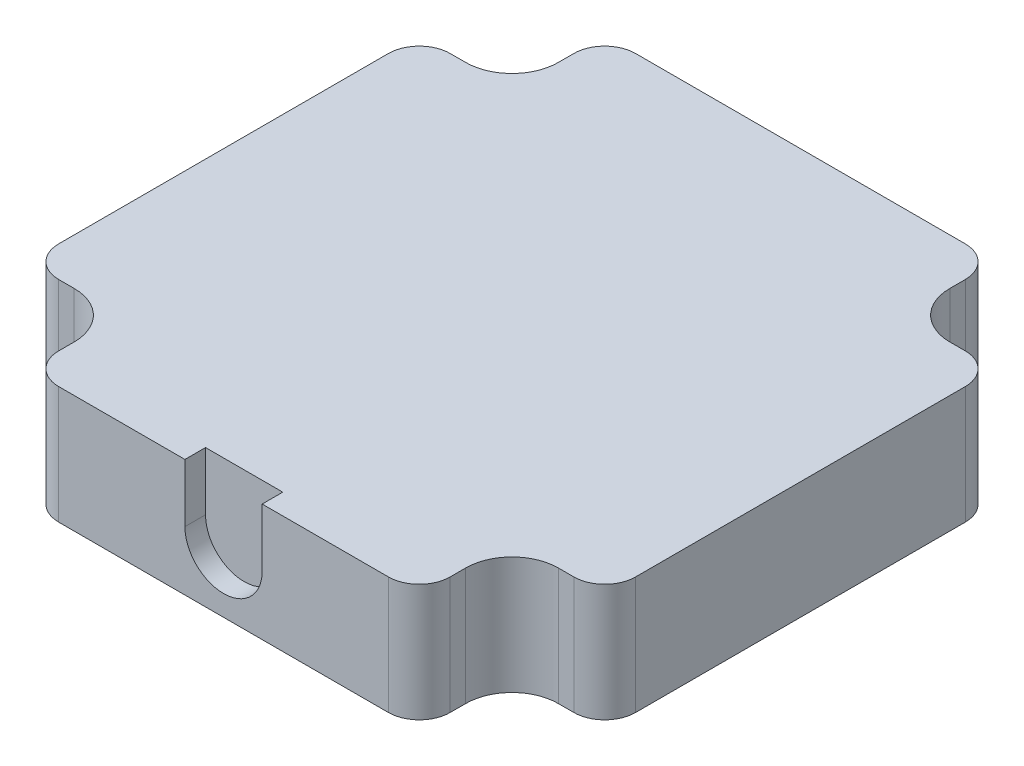
ISO-10303-21;
HEADER;
FILE_DESCRIPTION(('STEP AP214'),'2;1');
FILE_NAME('part.step','',(''),(''),'','','');
FILE_SCHEMA(('AUTOMOTIVE_DESIGN { 1 0 10303 214 1 1 1 1 }'));
ENDSEC;
DATA;
#1=APPLICATION_CONTEXT('core data for automotive mechanical design processes');
#2=APPLICATION_PROTOCOL_DEFINITION('international standard','automotive_design',2000,#1);
#3=PRODUCT_CONTEXT('',#1,'mechanical');
#4=PRODUCT('Part','Part','',(#3));
#5=PRODUCT_RELATED_PRODUCT_CATEGORY('part','',(#4));
#6=PRODUCT_DEFINITION_FORMATION('','',#4);
#7=PRODUCT_DEFINITION_CONTEXT('part definition',#1,'design');
#8=PRODUCT_DEFINITION('design','',#6,#7);
#9=PRODUCT_DEFINITION_SHAPE('','',#8);
#10=(LENGTH_UNIT() NAMED_UNIT(*) SI_UNIT(.MILLI.,.METRE.));
#11=(NAMED_UNIT(*) PLANE_ANGLE_UNIT() SI_UNIT($,.RADIAN.));
#12=(NAMED_UNIT(*) SI_UNIT($,.STERADIAN.) SOLID_ANGLE_UNIT());
#13=UNCERTAINTY_MEASURE_WITH_UNIT(LENGTH_MEASURE(1.E-05),#10,'distance_accuracy_value','');
#14=(GEOMETRIC_REPRESENTATION_CONTEXT(3) GLOBAL_UNCERTAINTY_ASSIGNED_CONTEXT((#13)) GLOBAL_UNIT_ASSIGNED_CONTEXT((#10,
#11,#12)) REPRESENTATION_CONTEXT('',''));
#15=CARTESIAN_POINT('',(0.,0.,0.));
#16=DIRECTION('',(0.,0.,1.));
#17=DIRECTION('',(1.,0.,0.));
#18=AXIS2_PLACEMENT_3D('',#15,#16,#17);
#19=CARTESIAN_POINT('',(85.5,43.3100000000018,125.18));
#20=DIRECTION('',(0.,-1.,0.));
#21=DIRECTION('',(-1.,0.,0.));
#22=AXIS2_PLACEMENT_3D('',#19,#20,#21);
#23=PLANE('',#22);
#24=CARTESIAN_POINT('',(110.6,43.3100000000017,81.08));
#25=DIRECTION('',(0.,-1.,0.));
#26=DIRECTION('',(1.,0.,0.));
#27=AXIS2_PLACEMENT_3D('',#24,#25,#26);
#28=CIRCLE('',#27,1.6);
#29=CARTESIAN_POINT('',(112.2,43.3100000000017,81.08));
#30=VERTEX_POINT('',#29);
#31=EDGE_CURVE('E343',#30,#30,#28,.T.);
#32=ORIENTED_EDGE('',*,*,#31,.T.);
#33=EDGE_LOOP('',(#32));
#34=FACE_BOUND('',#33,.T.);
#35=ADVANCED_FACE('F17',(#34),#23,.T.);
#36=CARTESIAN_POINT('',(69.4,43.3100000000019,72.08));
#37=DIRECTION('',(0.,-1.,0.));
#38=DIRECTION('',(1.,0.,0.));
#39=AXIS2_PLACEMENT_3D('',#36,#37,#38);
#40=CIRCLE('',#39,1.6);
#41=CARTESIAN_POINT('',(71.,43.3100000000018,72.08));
#42=VERTEX_POINT('',#41);
#43=EDGE_CURVE('E650',#42,#42,#40,.T.);
#44=ORIENTED_EDGE('',*,*,#43,.T.);
#45=EDGE_LOOP('',(#44));
#46=FACE_BOUND('',#45,.T.);
#47=ADVANCED_FACE('F797',(#46),#23,.T.);
#48=CARTESIAN_POINT('',(60.4,43.3100000000019,113.28));
#49=DIRECTION('',(0.,-1.,0.));
#50=DIRECTION('',(1.,0.,0.));
#51=AXIS2_PLACEMENT_3D('',#48,#49,#50);
#52=CIRCLE('',#51,1.6);
#53=CARTESIAN_POINT('',(62.,43.3100000000019,113.28));
#54=VERTEX_POINT('',#53);
#55=EDGE_CURVE('E655',#54,#54,#52,.T.);
#56=ORIENTED_EDGE('',*,*,#55,.T.);
#57=EDGE_LOOP('',(#56));
#58=FACE_BOUND('',#57,.T.);
#59=ADVANCED_FACE('F800',(#58),#23,.T.);
#60=CARTESIAN_POINT('',(101.6,43.3100000000017,122.28));
#61=DIRECTION('',(0.,-1.,0.));
#62=DIRECTION('',(1.,0.,0.));
#63=AXIS2_PLACEMENT_3D('',#60,#61,#62);
#64=CIRCLE('',#63,1.6);
#65=CARTESIAN_POINT('',(103.2,43.3100000000017,122.28));
#66=VERTEX_POINT('',#65);
#67=EDGE_CURVE('E374',#66,#66,#64,.T.);
#68=ORIENTED_EDGE('',*,*,#67,.T.);
#69=EDGE_LOOP('',(#68));
#70=FACE_BOUND('',#69,.T.);
#71=ADVANCED_FACE('F806',(#70),#23,.T.);
#72=CARTESIAN_POINT('',(59.75,40.3100000000019,116.18));
#73=DIRECTION('',(0.,0.,1.));
#74=DIRECTION('',(0.,1.,0.));
#75=AXIS2_PLACEMENT_3D('',#72,#73,#74);
#76=PLANE('',#75);
#77=DIRECTION('',(1.,0.,0.));
#78=VECTOR('',#77,1.);
#79=CARTESIAN_POINT('',(101.5,51.7100000000017,116.18));
#80=LINE('',#79,#78);
#81=CARTESIAN_POINT('',(109.,51.7100000000017,116.18));
#82=VERTEX_POINT('',#81);
#83=CARTESIAN_POINT('',(110.5,51.7100000000017,116.18));
#84=VERTEX_POINT('',#83);
#85=EDGE_CURVE('E142',#82,#84,#80,.T.);
#86=ORIENTED_EDGE('',*,*,#85,.F.);
#87=DIRECTION('',(0.,1.,0.));
#88=VECTOR('',#87,1.);
#89=CARTESIAN_POINT('',(109.,40.3100000000017,116.18));
#90=LINE('',#89,#88);
#91=CARTESIAN_POINT('',(109.,40.3100000000017,116.18));
#92=VERTEX_POINT('',#91);
#93=EDGE_CURVE('E28',#92,#82,#90,.T.);
#94=ORIENTED_EDGE('',*,*,#93,.F.);
#95=DIRECTION('',(1.,0.,0.));
#96=VECTOR('',#95,1.);
#97=CARTESIAN_POINT('',(59.75,40.3100000000019,116.18));
#98=LINE('',#97,#96);
#99=CARTESIAN_POINT('',(110.5,40.3100000000017,116.18));
#100=VERTEX_POINT('',#99);
#101=EDGE_CURVE('E140',#92,#100,#98,.T.);
#102=ORIENTED_EDGE('',*,*,#101,.T.);
#103=DIRECTION('',(0.,-1.,0.));
#104=VECTOR('',#103,1.);
#105=CARTESIAN_POINT('',(110.5,55.3100000000017,116.18));
#106=LINE('',#105,#104);
#107=EDGE_CURVE('E11',#84,#100,#106,.T.);
#108=ORIENTED_EDGE('',*,*,#107,.F.);
#109=EDGE_LOOP('',(#86,#94,#102,#108));
#110=FACE_BOUND('',#109,.T.);
#111=ADVANCED_FACE('F137',(#110),#76,.T.);
#112=CARTESIAN_POINT('',(109.,40.3100000000017,120.68));
#113=DIRECTION('',(0.,-1.,0.));
#114=DIRECTION('',(1.,0.,0.));
#115=AXIS2_PLACEMENT_3D('',#112,#113,#114);
#116=CYLINDRICAL_SURFACE('',#115,4.5);
#117=CARTESIAN_POINT('',(109.,51.7100000000017,120.68));
#118=DIRECTION('',(0.,-1.,0.));
#119=DIRECTION('',(1.,0.,0.));
#120=AXIS2_PLACEMENT_3D('',#117,#118,#119);
#121=CIRCLE('',#120,4.5);
#122=CARTESIAN_POINT('',(104.5,51.7100000000017,120.68));
#123=VERTEX_POINT('',#122);
#124=EDGE_CURVE('E178',#123,#82,#121,.T.);
#125=ORIENTED_EDGE('',*,*,#124,.F.);
#126=DIRECTION('',(0.,1.,0.));
#127=VECTOR('',#126,1.);
#128=CARTESIAN_POINT('',(104.5,40.3100000000017,120.68));
#129=LINE('',#128,#127);
#130=CARTESIAN_POINT('',(104.5,40.3100000000017,120.68));
#131=VERTEX_POINT('',#130);
#132=EDGE_CURVE('E147',#131,#123,#129,.T.);
#133=ORIENTED_EDGE('',*,*,#132,.F.);
#134=CARTESIAN_POINT('',(109.,40.3100000000017,120.68));
#135=DIRECTION('',(0.,-1.,0.));
#136=DIRECTION('',(1.,0.,0.));
#137=AXIS2_PLACEMENT_3D('',#134,#135,#136);
#138=CIRCLE('',#137,4.5);
#139=EDGE_CURVE('E150',#131,#92,#138,.T.);
#140=ORIENTED_EDGE('',*,*,#139,.T.);
#141=ORIENTED_EDGE('',*,*,#93,.T.);
#142=EDGE_LOOP('',(#125,#133,#140,#141));
#143=FACE_BOUND('',#142,.T.);
#144=ADVANCED_FACE('F151',(#143),#116,.F.);
#145=CARTESIAN_POINT('',(104.5,40.3100000000017,71.43));
#146=DIRECTION('',(1.,0.,0.));
#147=DIRECTION('',(0.,-1.,0.));
#148=AXIS2_PLACEMENT_3D('',#145,#146,#147);
#149=PLANE('',#148);
#150=DIRECTION('',(0.,0.,-1.));
#151=VECTOR('',#150,1.);
#152=CARTESIAN_POINT('',(104.5,51.7100000000017,122.18));
#153=LINE('',#152,#151);
#154=CARTESIAN_POINT('',(104.5,51.7100000000017,122.18));
#155=VERTEX_POINT('',#154);
#156=EDGE_CURVE('E174',#155,#123,#153,.T.);
#157=ORIENTED_EDGE('',*,*,#156,.F.);
#158=DIRECTION('',(0.,1.,0.));
#159=VECTOR('',#158,1.);
#160=CARTESIAN_POINT('',(104.5,17.3100000000017,122.18));
#161=LINE('',#160,#159);
#162=CARTESIAN_POINT('',(104.5,40.3100000000017,122.18));
#163=VERTEX_POINT('',#162);
#164=EDGE_CURVE('E180',#163,#155,#161,.T.);
#165=ORIENTED_EDGE('',*,*,#164,.F.);
#166=DIRECTION('',(0.,0.,-1.));
#167=VECTOR('',#166,1.);
#168=CARTESIAN_POINT('',(104.5,40.3100000000017,71.43));
#169=LINE('',#168,#167);
#170=EDGE_CURVE('E155',#163,#131,#169,.T.);
#171=ORIENTED_EDGE('',*,*,#170,.T.);
#172=ORIENTED_EDGE('',*,*,#132,.T.);
#173=EDGE_LOOP('',(#157,#165,#171,#172));
#174=FACE_BOUND('',#173,.T.);
#175=ADVANCED_FACE('F705',(#174),#149,.T.);
#176=CARTESIAN_POINT('',(81.,-5.6899999999982,125.18));
#177=DIRECTION('',(0.,0.,-1.));
#178=DIRECTION('',(0.,-1.,0.));
#179=AXIS2_PLACEMENT_3D('',#176,#177,#178);
#180=PLANE('',#179);
#181=DIRECTION('',(0.,1.,0.));
#182=VECTOR('',#181,1.);
#183=CARTESIAN_POINT('',(81.75,46.0600000000018,125.18));
#184=LINE('',#183,#182);
#185=CARTESIAN_POINT('',(81.75,46.0600000000018,125.18));
#186=VERTEX_POINT('',#185);
#187=CARTESIAN_POINT('',(81.75,51.7100000000018,125.18));
#188=VERTEX_POINT('',#187);
#189=EDGE_CURVE('E198',#186,#188,#184,.T.);
#190=ORIENTED_EDGE('',*,*,#189,.T.);
#191=DIRECTION('',(-1.,0.,0.));
#192=VECTOR('',#191,1.);
#193=CARTESIAN_POINT('',(91.25,51.7100000000018,125.18));
#194=LINE('',#193,#192);
#195=CARTESIAN_POINT('',(69.5,51.7100000000019,125.18));
#196=VERTEX_POINT('',#195);
#197=EDGE_CURVE('E338',#188,#196,#194,.T.);
#198=ORIENTED_EDGE('',*,*,#197,.T.);
#199=DIRECTION('',(0.,1.,0.));
#200=VECTOR('',#199,1.);
#201=CARTESIAN_POINT('',(69.5,17.3100000000018,125.18));
#202=LINE('',#201,#200);
#203=CARTESIAN_POINT('',(69.5,40.3100000000018,125.18));
#204=VERTEX_POINT('',#203);
#205=EDGE_CURVE('E324',#204,#196,#202,.T.);
#206=ORIENTED_EDGE('',*,*,#205,.F.);
#207=DIRECTION('',(-1.,0.,0.));
#208=VECTOR('',#207,1.);
#209=CARTESIAN_POINT('',(113.5,40.3100000000017,125.18));
#210=LINE('',#209,#208);
#211=CARTESIAN_POINT('',(101.5,40.3100000000017,125.18));
#212=VERTEX_POINT('',#211);
#213=EDGE_CURVE('E188',#212,#204,#210,.T.);
#214=ORIENTED_EDGE('',*,*,#213,.F.);
#215=DIRECTION('',(0.,-1.,0.));
#216=VECTOR('',#215,1.);
#217=CARTESIAN_POINT('',(101.5,17.3100000000017,125.18));
#218=LINE('',#217,#216);
#219=CARTESIAN_POINT('',(101.5,51.7100000000017,125.18));
#220=VERTEX_POINT('',#219);
#221=EDGE_CURVE('E173',#220,#212,#218,.T.);
#222=ORIENTED_EDGE('',*,*,#221,.F.);
#223=CARTESIAN_POINT('',(89.25,51.7100000000018,125.18));
#224=VERTEX_POINT('',#223);
#225=EDGE_CURVE('E179',#220,#224,#194,.T.);
#226=ORIENTED_EDGE('',*,*,#225,.T.);
#227=DIRECTION('',(0.,1.,0.));
#228=VECTOR('',#227,1.);
#229=CARTESIAN_POINT('',(89.25,46.0600000000018,125.18));
#230=LINE('',#229,#228);
#231=CARTESIAN_POINT('',(89.25,46.0600000000018,125.18));
#232=VERTEX_POINT('',#231);
#233=EDGE_CURVE('E349',#232,#224,#230,.T.);
#234=ORIENTED_EDGE('',*,*,#233,.F.);
#235=CARTESIAN_POINT('',(85.5,46.0600000000018,125.18));
#236=DIRECTION('',(0.,0.,1.));
#237=DIRECTION('',(-1.,0.,0.));
#238=AXIS2_PLACEMENT_3D('',#235,#236,#237);
#239=CIRCLE('',#238,3.75);
#240=EDGE_CURVE('E358',#186,#232,#239,.T.);
#241=ORIENTED_EDGE('',*,*,#240,.F.);
#242=EDGE_LOOP('',(#190,#198,#206,#214,#222,#226,#234,#241));
#243=FACE_BOUND('',#242,.T.);
#244=ADVANCED_FACE('F794',(#243),#180,.F.);
#245=CARTESIAN_POINT('',(66.5,40.3100000000018,71.43));
#246=DIRECTION('',(-1.,0.,0.));
#247=DIRECTION('',(0.,1.,0.));
#248=AXIS2_PLACEMENT_3D('',#245,#246,#247);
#249=PLANE('',#248);
#250=DIRECTION('',(0.,0.,1.));
#251=VECTOR('',#250,1.);
#252=CARTESIAN_POINT('',(66.5,51.7100000000018,122.18));
#253=LINE('',#252,#251);
#254=CARTESIAN_POINT('',(66.5,51.7100000000019,120.68));
#255=VERTEX_POINT('',#254);
#256=CARTESIAN_POINT('',(66.5,51.7100000000018,122.18));
#257=VERTEX_POINT('',#256);
#258=EDGE_CURVE('E194',#255,#257,#253,.T.);
#259=ORIENTED_EDGE('',*,*,#258,.F.);
#260=DIRECTION('',(0.,1.,0.));
#261=VECTOR('',#260,1.);
#262=CARTESIAN_POINT('',(66.5,40.3100000000019,120.68));
#263=LINE('',#262,#261);
#264=CARTESIAN_POINT('',(66.5,40.3100000000019,120.68));
#265=VERTEX_POINT('',#264);
#266=EDGE_CURVE('E193',#265,#255,#263,.T.);
#267=ORIENTED_EDGE('',*,*,#266,.F.);
#268=DIRECTION('',(0.,0.,1.));
#269=VECTOR('',#268,1.);
#270=CARTESIAN_POINT('',(66.5,40.3100000000018,71.43));
#271=LINE('',#270,#269);
#272=CARTESIAN_POINT('',(66.5,40.3100000000018,122.18));
#273=VERTEX_POINT('',#272);
#274=EDGE_CURVE('E203',#265,#273,#271,.T.);
#275=ORIENTED_EDGE('',*,*,#274,.T.);
#276=DIRECTION('',(0.,-1.,0.));
#277=VECTOR('',#276,1.);
#278=CARTESIAN_POINT('',(66.5,17.3100000000018,122.18));
#279=LINE('',#278,#277);
#280=EDGE_CURVE('E189',#257,#273,#279,.T.);
#281=ORIENTED_EDGE('',*,*,#280,.F.);
#282=EDGE_LOOP('',(#259,#267,#275,#281));
#283=FACE_BOUND('',#282,.T.);
#284=ADVANCED_FACE('F784',(#283),#249,.T.);
#285=CARTESIAN_POINT('',(62.,40.3100000000019,120.68));
#286=DIRECTION('',(0.,-1.,0.));
#287=DIRECTION('',(0.,0.,1.));
#288=AXIS2_PLACEMENT_3D('',#285,#286,#287);
#289=CYLINDRICAL_SURFACE('',#288,4.5);
#290=CARTESIAN_POINT('',(62.,51.7100000000019,120.68));
#291=DIRECTION('',(0.,-1.,0.));
#292=DIRECTION('',(0.,0.,1.));
#293=AXIS2_PLACEMENT_3D('',#290,#291,#292);
#294=CIRCLE('',#293,4.5);
#295=CARTESIAN_POINT('',(62.,51.7100000000019,116.18));
#296=VERTEX_POINT('',#295);
#297=EDGE_CURVE('E199',#296,#255,#294,.T.);
#298=ORIENTED_EDGE('',*,*,#297,.F.);
#299=DIRECTION('',(0.,1.,0.));
#300=VECTOR('',#299,1.);
#301=CARTESIAN_POINT('',(62.,40.3100000000019,116.18));
#302=LINE('',#301,#300);
#303=CARTESIAN_POINT('',(62.,40.3100000000019,116.18));
#304=VERTEX_POINT('',#303);
#305=EDGE_CURVE('E202',#304,#296,#302,.T.);
#306=ORIENTED_EDGE('',*,*,#305,.F.);
#307=CARTESIAN_POINT('',(62.,40.3100000000019,120.68));
#308=DIRECTION('',(0.,-1.,0.));
#309=DIRECTION('',(0.,0.,1.));
#310=AXIS2_PLACEMENT_3D('',#307,#308,#309);
#311=CIRCLE('',#310,4.5);
#312=EDGE_CURVE('E207',#304,#265,#311,.T.);
#313=ORIENTED_EDGE('',*,*,#312,.T.);
#314=ORIENTED_EDGE('',*,*,#266,.T.);
#315=EDGE_LOOP('',(#298,#306,#313,#314));
#316=FACE_BOUND('',#315,.T.);
#317=ADVANCED_FACE('F785',(#316),#289,.F.);
#318=DIRECTION('',(1.,0.,0.));
#319=VECTOR('',#318,1.);
#320=CARTESIAN_POINT('',(80.625,51.7100000000018,116.18));
#321=LINE('',#320,#319);
#322=CARTESIAN_POINT('',(60.5,51.7100000000019,116.18));
#323=VERTEX_POINT('',#322);
#324=EDGE_CURVE('E431',#323,#296,#321,.T.);
#325=ORIENTED_EDGE('',*,*,#324,.F.);
#326=DIRECTION('',(0.,1.,0.));
#327=VECTOR('',#326,1.);
#328=CARTESIAN_POINT('',(60.5,55.3100000000019,116.18));
#329=LINE('',#328,#327);
#330=CARTESIAN_POINT('',(60.5,40.3100000000019,116.18));
#331=VERTEX_POINT('',#330);
#332=EDGE_CURVE('E212',#331,#323,#329,.T.);
#333=ORIENTED_EDGE('',*,*,#332,.F.);
#334=DIRECTION('',(1.,0.,0.));
#335=VECTOR('',#334,1.);
#336=CARTESIAN_POINT('',(72.625,40.3100000000018,116.18));
#337=LINE('',#336,#335);
#338=EDGE_CURVE('E444',#331,#304,#337,.T.);
#339=ORIENTED_EDGE('',*,*,#338,.T.);
#340=ORIENTED_EDGE('',*,*,#305,.T.);
#341=EDGE_LOOP('',(#325,#333,#339,#340));
#342=FACE_BOUND('',#341,.T.);
#343=ADVANCED_FACE('F754',(#342),#76,.T.);
#344=CARTESIAN_POINT('',(57.5,70.3100000000019,125.18));
#345=DIRECTION('',(-1.,0.,0.));
#346=DIRECTION('',(0.,1.,0.));
#347=AXIS2_PLACEMENT_3D('',#344,#345,#346);
#348=PLANE('',#347);
#349=DIRECTION('',(0.,0.,1.));
#350=VECTOR('',#349,1.);
#351=CARTESIAN_POINT('',(57.5,51.7100000000019,123.68));
#352=LINE('',#351,#350);
#353=CARTESIAN_POINT('',(57.5,51.7100000000019,81.18));
#354=VERTEX_POINT('',#353);
#355=CARTESIAN_POINT('',(57.5,51.7100000000019,113.18));
#356=VERTEX_POINT('',#355);
#357=EDGE_CURVE('E427',#354,#356,#352,.T.);
#358=ORIENTED_EDGE('',*,*,#357,.F.);
#359=DIRECTION('',(0.,1.,0.));
#360=VECTOR('',#359,1.);
#361=CARTESIAN_POINT('',(57.5,55.3100000000019,81.18));
#362=LINE('',#361,#360);
#363=CARTESIAN_POINT('',(57.5,40.3100000000019,81.18));
#364=VERTEX_POINT('',#363);
#365=EDGE_CURVE('E312',#364,#354,#362,.T.);
#366=ORIENTED_EDGE('',*,*,#365,.F.);
#367=DIRECTION('',(0.,0.,-1.));
#368=VECTOR('',#367,1.);
#369=CARTESIAN_POINT('',(57.5,40.3100000000019,125.18));
#370=LINE('',#369,#368);
#371=CARTESIAN_POINT('',(57.5,40.3100000000019,113.18));
#372=VERTEX_POINT('',#371);
#373=EDGE_CURVE('E410',#372,#364,#370,.T.);
#374=ORIENTED_EDGE('',*,*,#373,.F.);
#375=DIRECTION('',(0.,-1.,0.));
#376=VECTOR('',#375,1.);
#377=CARTESIAN_POINT('',(57.5,55.3100000000019,113.18));
#378=LINE('',#377,#376);
#379=EDGE_CURVE('E316',#356,#372,#378,.T.);
#380=ORIENTED_EDGE('',*,*,#379,.F.);
#381=EDGE_LOOP('',(#358,#366,#374,#380));
#382=FACE_BOUND('',#381,.T.);
#383=ADVANCED_FACE('F742',(#382),#348,.T.);
#384=CARTESIAN_POINT('',(81.,-5.6899999999982,69.18));
#385=DIRECTION('',(0.,0.,-1.));
#386=DIRECTION('',(0.,-1.,0.));
#387=AXIS2_PLACEMENT_3D('',#384,#385,#386);
#388=PLANE('',#387);
#389=DIRECTION('',(-1.,0.,0.));
#390=VECTOR('',#389,1.);
#391=CARTESIAN_POINT('',(91.25,51.7100000000018,69.18));
#392=LINE('',#391,#390);
#393=CARTESIAN_POINT('',(101.5,51.7100000000018,69.18));
#394=VERTEX_POINT('',#393);
#395=CARTESIAN_POINT('',(69.5,51.7100000000019,69.18));
#396=VERTEX_POINT('',#395);
#397=EDGE_CURVE('E259',#394,#396,#392,.T.);
#398=ORIENTED_EDGE('',*,*,#397,.F.);
#399=DIRECTION('',(0.,1.,0.));
#400=VECTOR('',#399,1.);
#401=CARTESIAN_POINT('',(101.5,17.3100000000017,69.18));
#402=LINE('',#401,#400);
#403=CARTESIAN_POINT('',(101.5,40.3100000000017,69.18));
#404=VERTEX_POINT('',#403);
#405=EDGE_CURVE('E400',#404,#394,#402,.T.);
#406=ORIENTED_EDGE('',*,*,#405,.F.);
#407=DIRECTION('',(1.,0.,0.));
#408=VECTOR('',#407,1.);
#409=CARTESIAN_POINT('',(113.5,40.3100000000017,69.18));
#410=LINE('',#409,#408);
#411=CARTESIAN_POINT('',(69.5,40.3100000000018,69.18));
#412=VERTEX_POINT('',#411);
#413=EDGE_CURVE('E213',#412,#404,#410,.T.);
#414=ORIENTED_EDGE('',*,*,#413,.F.);
#415=DIRECTION('',(0.,-1.,0.));
#416=VECTOR('',#415,1.);
#417=CARTESIAN_POINT('',(69.5,17.3100000000018,69.18));
#418=LINE('',#417,#416);
#419=EDGE_CURVE('E304',#396,#412,#418,.T.);
#420=ORIENTED_EDGE('',*,*,#419,.F.);
#421=EDGE_LOOP('',(#398,#406,#414,#420));
#422=FACE_BOUND('',#421,.T.);
#423=ADVANCED_FACE('F951',(#422),#388,.T.);
#424=CARTESIAN_POINT('',(59.75,40.3100000000019,78.18));
#425=DIRECTION('',(0.,0.,-1.));
#426=DIRECTION('',(0.,-1.,0.));
#427=AXIS2_PLACEMENT_3D('',#424,#425,#426);
#428=PLANE('',#427);
#429=DIRECTION('',(-1.,0.,0.));
#430=VECTOR('',#429,1.);
#431=CARTESIAN_POINT('',(101.5,51.7100000000017,78.18));
#432=LINE('',#431,#430);
#433=CARTESIAN_POINT('',(110.5,51.7100000000017,78.18));
#434=VERTEX_POINT('',#433);
#435=CARTESIAN_POINT('',(109.,51.7100000000017,78.18));
#436=VERTEX_POINT('',#435);
#437=EDGE_CURVE('E214',#434,#436,#432,.T.);
#438=ORIENTED_EDGE('',*,*,#437,.F.);
#439=DIRECTION('',(0.,1.,0.));
#440=VECTOR('',#439,1.);
#441=CARTESIAN_POINT('',(110.5,55.3100000000017,78.18));
#442=LINE('',#441,#440);
#443=CARTESIAN_POINT('',(110.5,40.3100000000017,78.18));
#444=VERTEX_POINT('',#443);
#445=EDGE_CURVE('E208',#444,#434,#442,.T.);
#446=ORIENTED_EDGE('',*,*,#445,.F.);
#447=DIRECTION('',(-1.,0.,0.));
#448=VECTOR('',#447,1.);
#449=CARTESIAN_POINT('',(59.75,40.3100000000019,78.18));
#450=LINE('',#449,#448);
#451=CARTESIAN_POINT('',(109.,40.3100000000017,78.18));
#452=VERTEX_POINT('',#451);
#453=EDGE_CURVE('E164',#444,#452,#450,.T.);
#454=ORIENTED_EDGE('',*,*,#453,.T.);
#455=DIRECTION('',(0.,1.,0.));
#456=VECTOR('',#455,1.);
#457=CARTESIAN_POINT('',(109.,40.3100000000017,78.18));
#458=LINE('',#457,#456);
#459=EDGE_CURVE('E21',#452,#436,#458,.T.);
#460=ORIENTED_EDGE('',*,*,#459,.T.);
#461=EDGE_LOOP('',(#438,#446,#454,#460));
#462=FACE_BOUND('',#461,.T.);
#463=ADVANCED_FACE('F19',(#462),#428,.T.);
#464=CARTESIAN_POINT('',(85.5,40.3100000000018,125.18));
#465=DIRECTION('',(0.,-1.,0.));
#466=DIRECTION('',(-1.,0.,0.));
#467=AXIS2_PLACEMENT_3D('',#464,#465,#466);
#468=PLANE('',#467);
#469=CARTESIAN_POINT('',(101.5,40.3100000000017,72.18));
#470=DIRECTION('',(0.,1.,0.));
#471=DIRECTION('',(0.707106781186551,0.,-0.707106781186544));
#472=AXIS2_PLACEMENT_3D('',#469,#470,#471);
#473=CIRCLE('',#472,3.);
#474=CARTESIAN_POINT('',(104.5,40.3100000000017,72.18));
#475=VERTEX_POINT('',#474);
#476=EDGE_CURVE('E404',#475,#404,#473,.T.);
#477=ORIENTED_EDGE('',*,*,#476,.F.);
#478=DIRECTION('',(0.,0.,-1.));
#479=VECTOR('',#478,1.);
#480=CARTESIAN_POINT('',(104.5,40.3100000000017,98.305));
#481=LINE('',#480,#479);
#482=CARTESIAN_POINT('',(104.5,40.3100000000017,73.68));
#483=VERTEX_POINT('',#482);
#484=EDGE_CURVE('E268',#483,#475,#481,.T.);
#485=ORIENTED_EDGE('',*,*,#484,.F.);
#486=CARTESIAN_POINT('',(109.,40.3100000000017,73.68));
#487=DIRECTION('',(0.,-1.,0.));
#488=DIRECTION('',(0.,0.,-1.));
#489=AXIS2_PLACEMENT_3D('',#486,#487,#488);
#490=CIRCLE('',#489,4.5);
#491=EDGE_CURVE('E291',#452,#483,#490,.T.);
#492=ORIENTED_EDGE('',*,*,#491,.F.);
#493=ORIENTED_EDGE('',*,*,#453,.F.);
#494=CARTESIAN_POINT('',(110.5,40.3100000000017,81.18));
#495=DIRECTION('',(0.,1.,0.));
#496=DIRECTION('',(0.707106781186557,0.,-0.707106781186538));
#497=AXIS2_PLACEMENT_3D('',#494,#495,#496);
#498=CIRCLE('',#497,3.);
#499=CARTESIAN_POINT('',(113.5,40.3100000000017,81.18));
#500=VERTEX_POINT('',#499);
#501=EDGE_CURVE('E252',#500,#444,#498,.T.);
#502=ORIENTED_EDGE('',*,*,#501,.F.);
#503=DIRECTION('',(0.,0.,-1.));
#504=VECTOR('',#503,1.);
#505=CARTESIAN_POINT('',(113.5,40.3100000000017,125.18));
#506=LINE('',#505,#504);
#507=CARTESIAN_POINT('',(113.5,40.3100000000017,113.18));
#508=VERTEX_POINT('',#507);
#509=EDGE_CURVE('E269',#508,#500,#506,.T.);
#510=ORIENTED_EDGE('',*,*,#509,.F.);
#511=CARTESIAN_POINT('',(110.5,40.3100000000017,113.18));
#512=DIRECTION('',(0.,1.,0.));
#513=DIRECTION('',(0.707106781186544,0.,0.707106781186551));
#514=AXIS2_PLACEMENT_3D('',#511,#512,#513);
#515=CIRCLE('',#514,3.);
#516=EDGE_CURVE('E162',#100,#508,#515,.T.);
#517=ORIENTED_EDGE('',*,*,#516,.F.);
#518=ORIENTED_EDGE('',*,*,#101,.F.);
#519=ORIENTED_EDGE('',*,*,#139,.F.);
#520=ORIENTED_EDGE('',*,*,#170,.F.);
#521=CARTESIAN_POINT('',(101.5,40.3100000000017,122.18));
#522=DIRECTION('',(0.,1.,0.));
#523=DIRECTION('',(0.707106781186541,0.,0.707106781186554));
#524=AXIS2_PLACEMENT_3D('',#521,#522,#523);
#525=CIRCLE('',#524,3.);
#526=EDGE_CURVE('E185',#212,#163,#525,.T.);
#527=ORIENTED_EDGE('',*,*,#526,.F.);
#528=ORIENTED_EDGE('',*,*,#213,.T.);
#529=CARTESIAN_POINT('',(69.5,40.3100000000018,122.18));
#530=DIRECTION('',(0.,1.,0.));
#531=DIRECTION('',(-0.707106781186551,0.,0.707106781186544));
#532=AXIS2_PLACEMENT_3D('',#529,#530,#531);
#533=CIRCLE('',#532,3.);
#534=EDGE_CURVE('E687',#273,#204,#533,.T.);
#535=ORIENTED_EDGE('',*,*,#534,.F.);
#536=ORIENTED_EDGE('',*,*,#274,.F.);
#537=ORIENTED_EDGE('',*,*,#312,.F.);
#538=ORIENTED_EDGE('',*,*,#338,.F.);
#539=CARTESIAN_POINT('',(60.5,40.3100000000019,113.18));
#540=DIRECTION('',(0.,1.,0.));
#541=DIRECTION('',(-0.707106781186554,0.,0.707106781186541));
#542=AXIS2_PLACEMENT_3D('',#539,#540,#541);
#543=CIRCLE('',#542,3.);
#544=EDGE_CURVE('E41',#372,#331,#543,.T.);
#545=ORIENTED_EDGE('',*,*,#544,.F.);
#546=ORIENTED_EDGE('',*,*,#373,.T.);
#547=CARTESIAN_POINT('',(60.5,40.3100000000019,81.18));
#548=DIRECTION('',(0.,1.,0.));
#549=DIRECTION('',(-0.707106781186539,0.,-0.707106781186556));
#550=AXIS2_PLACEMENT_3D('',#547,#548,#549);
#551=CIRCLE('',#550,3.);
#552=CARTESIAN_POINT('',(60.5,40.3100000000019,78.18));
#553=VERTEX_POINT('',#552);
#554=EDGE_CURVE('E438',#553,#364,#551,.T.);
#555=ORIENTED_EDGE('',*,*,#554,.F.);
#556=DIRECTION('',(-1.,0.,0.));
#557=VECTOR('',#556,1.);
#558=CARTESIAN_POINT('',(72.625,40.3100000000018,78.18));
#559=LINE('',#558,#557);
#560=CARTESIAN_POINT('',(62.,40.3100000000019,78.18));
#561=VERTEX_POINT('',#560);
#562=EDGE_CURVE('E465',#561,#553,#559,.T.);
#563=ORIENTED_EDGE('',*,*,#562,.F.);
#564=CARTESIAN_POINT('',(62.,40.3100000000019,73.68));
#565=DIRECTION('',(0.,-1.,0.));
#566=DIRECTION('',(-1.,0.,0.));
#567=AXIS2_PLACEMENT_3D('',#564,#565,#566);
#568=CIRCLE('',#567,4.5);
#569=CARTESIAN_POINT('',(66.5,40.3100000000019,73.68));
#570=VERTEX_POINT('',#569);
#571=EDGE_CURVE('E283',#570,#561,#568,.T.);
#572=ORIENTED_EDGE('',*,*,#571,.F.);
#573=DIRECTION('',(0.,0.,1.));
#574=VECTOR('',#573,1.);
#575=CARTESIAN_POINT('',(66.5,40.3100000000019,98.305));
#576=LINE('',#575,#574);
#577=CARTESIAN_POINT('',(66.5,40.3100000000019,72.18));
#578=VERTEX_POINT('',#577);
#579=EDGE_CURVE('E168',#578,#570,#576,.T.);
#580=ORIENTED_EDGE('',*,*,#579,.F.);
#581=CARTESIAN_POINT('',(69.5,40.3100000000018,72.18));
#582=DIRECTION('',(0.,1.,0.));
#583=DIRECTION('',(-0.707106781186544,0.,-0.707106781186551));
#584=AXIS2_PLACEMENT_3D('',#581,#582,#583);
#585=CIRCLE('',#584,3.);
#586=EDGE_CURVE('E416',#412,#578,#585,.T.);
#587=ORIENTED_EDGE('',*,*,#586,.F.);
#588=ORIENTED_EDGE('',*,*,#413,.T.);
#589=EDGE_LOOP('',(#477,#485,#492,#493,#502,#510,#517,#518,#519,#520,#527,#528,#535,#536,#537,
#538,#545,#546,#555,#563,#572,#580,#587,#588));
#590=FACE_BOUND('',#589,.T.);
#591=CARTESIAN_POINT('',(85.5,40.3100000000018,97.18));
#592=DIRECTION('',(0.,-1.,0.));
#593=DIRECTION('',(1.,0.,0.));
#594=AXIS2_PLACEMENT_3D('',#591,#592,#593);
#595=CIRCLE('',#594,4.75);
#596=CARTESIAN_POINT('',(90.25,40.3100000000018,97.18));
#597=VERTEX_POINT('',#596);
#598=EDGE_CURVE('E423',#597,#597,#595,.T.);
#599=ORIENTED_EDGE('',*,*,#598,.F.);
#600=EDGE_LOOP('',(#599));
#601=FACE_BOUND('',#600,.T.);
#602=CARTESIAN_POINT('',(101.6,40.3100000000017,122.28));
#603=DIRECTION('',(0.,-1.,0.));
#604=DIRECTION('',(1.,0.,0.));
#605=AXIS2_PLACEMENT_3D('',#602,#603,#604);
#606=CIRCLE('',#605,1.6);
#607=CARTESIAN_POINT('',(103.2,40.3100000000017,122.28));
#608=VERTEX_POINT('',#607);
#609=EDGE_CURVE('E484',#608,#608,#606,.T.);
#610=ORIENTED_EDGE('',*,*,#609,.F.);
#611=EDGE_LOOP('',(#610));
#612=FACE_BOUND('',#611,.T.);
#613=CARTESIAN_POINT('',(60.4,40.3100000000019,113.28));
#614=DIRECTION('',(0.,-1.,0.));
#615=DIRECTION('',(0.,0.,1.));
#616=AXIS2_PLACEMENT_3D('',#613,#614,#615);
#617=CIRCLE('',#616,1.6);
#618=CARTESIAN_POINT('',(60.4,40.3100000000019,114.88));
#619=VERTEX_POINT('',#618);
#620=EDGE_CURVE('E656',#619,#619,#617,.T.);
#621=ORIENTED_EDGE('',*,*,#620,.F.);
#622=EDGE_LOOP('',(#621));
#623=FACE_BOUND('',#622,.T.);
#624=CARTESIAN_POINT('',(69.4,40.3100000000018,72.08));
#625=DIRECTION('',(0.,-1.,0.));
#626=DIRECTION('',(-1.,0.,0.));
#627=AXIS2_PLACEMENT_3D('',#624,#625,#626);
#628=CIRCLE('',#627,1.6);
#629=CARTESIAN_POINT('',(67.8,40.3100000000018,72.08));
#630=VERTEX_POINT('',#629);
#631=EDGE_CURVE('E651',#630,#630,#628,.T.);
#632=ORIENTED_EDGE('',*,*,#631,.F.);
#633=EDGE_LOOP('',(#632));
#634=FACE_BOUND('',#633,.T.);
#635=CARTESIAN_POINT('',(110.6,40.3100000000017,81.08));
#636=DIRECTION('',(0.,-1.,0.));
#637=DIRECTION('',(0.,0.,-1.));
#638=AXIS2_PLACEMENT_3D('',#635,#636,#637);
#639=CIRCLE('',#638,1.6);
#640=CARTESIAN_POINT('',(110.6,40.3100000000017,79.48));
#641=VERTEX_POINT('',#640);
#642=EDGE_CURVE('E646',#641,#641,#639,.T.);
#643=ORIENTED_EDGE('',*,*,#642,.F.);
#644=EDGE_LOOP('',(#643));
#645=FACE_BOUND('',#644,.T.);
#646=ADVANCED_FACE('F158',(#590,#601,#612,#623,#634,#645),#468,.T.);
#647=DIRECTION('',(0.,0.,1.));
#648=VECTOR('',#647,1.);
#649=CARTESIAN_POINT('',(66.5,51.7100000000019,96.805));
#650=LINE('',#649,#648);
#651=CARTESIAN_POINT('',(66.5,51.7100000000019,72.18));
#652=VERTEX_POINT('',#651);
#653=CARTESIAN_POINT('',(66.5,51.7100000000019,73.68));
#654=VERTEX_POINT('',#653);
#655=EDGE_CURVE('E272',#652,#654,#650,.T.);
#656=ORIENTED_EDGE('',*,*,#655,.F.);
#657=DIRECTION('',(0.,1.,0.));
#658=VECTOR('',#657,1.);
#659=CARTESIAN_POINT('',(66.5,17.3100000000019,72.18));
#660=LINE('',#659,#658);
#661=EDGE_CURVE('E287',#578,#652,#660,.T.);
#662=ORIENTED_EDGE('',*,*,#661,.F.);
#663=ORIENTED_EDGE('',*,*,#579,.T.);
#664=DIRECTION('',(0.,1.,0.));
#665=VECTOR('',#664,1.);
#666=CARTESIAN_POINT('',(66.5,40.3100000000018,73.68));
#667=LINE('',#666,#665);
#668=EDGE_CURVE('E279',#570,#654,#667,.T.);
#669=ORIENTED_EDGE('',*,*,#668,.T.);
#670=EDGE_LOOP('',(#656,#662,#663,#669));
#671=FACE_BOUND('',#670,.T.);
#672=ADVANCED_FACE('F615',(#671),#249,.T.);
#673=CARTESIAN_POINT('',(109.,40.3100000000017,73.68));
#674=DIRECTION('',(0.,-1.,0.));
#675=DIRECTION('',(0.,0.,-1.));
#676=AXIS2_PLACEMENT_3D('',#673,#674,#675);
#677=CYLINDRICAL_SURFACE('',#676,4.5);
#678=CARTESIAN_POINT('',(109.,51.7100000000017,73.68));
#679=DIRECTION('',(0.,-1.,0.));
#680=DIRECTION('',(0.,0.,-1.));
#681=AXIS2_PLACEMENT_3D('',#678,#679,#680);
#682=CIRCLE('',#681,4.5);
#683=CARTESIAN_POINT('',(104.5,51.7100000000017,73.68));
#684=VERTEX_POINT('',#683);
#685=EDGE_CURVE('E217',#436,#684,#682,.T.);
#686=ORIENTED_EDGE('',*,*,#685,.F.);
#687=ORIENTED_EDGE('',*,*,#459,.F.);
#688=ORIENTED_EDGE('',*,*,#491,.T.);
#689=DIRECTION('',(0.,1.,0.));
#690=VECTOR('',#689,1.);
#691=CARTESIAN_POINT('',(104.5,40.3100000000017,73.68));
#692=LINE('',#691,#690);
#693=EDGE_CURVE('E264',#483,#684,#692,.T.);
#694=ORIENTED_EDGE('',*,*,#693,.T.);
#695=EDGE_LOOP('',(#686,#687,#688,#694));
#696=FACE_BOUND('',#695,.T.);
#697=ADVANCED_FACE('F854',(#696),#677,.F.);
#698=DIRECTION('',(0.,0.,-1.));
#699=VECTOR('',#698,1.);
#700=CARTESIAN_POINT('',(104.5,51.7100000000017,96.805));
#701=LINE('',#700,#699);
#702=CARTESIAN_POINT('',(104.5,51.7100000000018,72.18));
#703=VERTEX_POINT('',#702);
#704=EDGE_CURVE('E225',#684,#703,#701,.T.);
#705=ORIENTED_EDGE('',*,*,#704,.F.);
#706=ORIENTED_EDGE('',*,*,#693,.F.);
#707=ORIENTED_EDGE('',*,*,#484,.T.);
#708=DIRECTION('',(0.,-1.,0.));
#709=VECTOR('',#708,1.);
#710=CARTESIAN_POINT('',(104.5,17.3100000000017,72.18));
#711=LINE('',#710,#709);
#712=EDGE_CURVE('E389',#703,#475,#711,.T.);
#713=ORIENTED_EDGE('',*,*,#712,.F.);
#714=EDGE_LOOP('',(#705,#706,#707,#713));
#715=FACE_BOUND('',#714,.T.);
#716=ADVANCED_FACE('F851',(#715),#149,.T.);
#717=CARTESIAN_POINT('',(113.5,70.3100000000017,125.18));
#718=DIRECTION('',(1.,0.,0.));
#719=DIRECTION('',(0.,-1.,0.));
#720=AXIS2_PLACEMENT_3D('',#717,#718,#719);
#721=PLANE('',#720);
#722=DIRECTION('',(0.,0.,-1.));
#723=VECTOR('',#722,1.);
#724=CARTESIAN_POINT('',(113.5,51.7100000000017,123.68));
#725=LINE('',#724,#723);
#726=CARTESIAN_POINT('',(113.5,51.7100000000017,113.18));
#727=VERTEX_POINT('',#726);
#728=CARTESIAN_POINT('',(113.5,51.7100000000017,81.18));
#729=VERTEX_POINT('',#728);
#730=EDGE_CURVE('E218',#727,#729,#725,.T.);
#731=ORIENTED_EDGE('',*,*,#730,.F.);
#732=DIRECTION('',(0.,1.,0.));
#733=VECTOR('',#732,1.);
#734=CARTESIAN_POINT('',(113.5,55.3100000000017,113.18));
#735=LINE('',#734,#733);
#736=EDGE_CURVE('E241',#508,#727,#735,.T.);
#737=ORIENTED_EDGE('',*,*,#736,.F.);
#738=ORIENTED_EDGE('',*,*,#509,.T.);
#739=DIRECTION('',(0.,-1.,0.));
#740=VECTOR('',#739,1.);
#741=CARTESIAN_POINT('',(113.5,55.3100000000017,81.18));
#742=LINE('',#741,#740);
#743=EDGE_CURVE('E248',#729,#500,#742,.T.);
#744=ORIENTED_EDGE('',*,*,#743,.F.);
#745=EDGE_LOOP('',(#731,#737,#738,#744));
#746=FACE_BOUND('',#745,.T.);
#747=ADVANCED_FACE('F864',(#746),#721,.T.);
#748=CARTESIAN_POINT('',(62.,40.3100000000019,73.68));
#749=DIRECTION('',(0.,-1.,0.));
#750=DIRECTION('',(-1.,0.,0.));
#751=AXIS2_PLACEMENT_3D('',#748,#749,#750);
#752=CYLINDRICAL_SURFACE('',#751,4.5);
#753=CARTESIAN_POINT('',(62.,51.7100000000019,73.68));
#754=DIRECTION('',(0.,-1.,0.));
#755=DIRECTION('',(-1.,0.,0.));
#756=AXIS2_PLACEMENT_3D('',#753,#754,#755);
#757=CIRCLE('',#756,4.5);
#758=CARTESIAN_POINT('',(62.,51.7100000000019,78.18));
#759=VERTEX_POINT('',#758);
#760=EDGE_CURVE('E276',#654,#759,#757,.T.);
#761=ORIENTED_EDGE('',*,*,#760,.F.);
#762=ORIENTED_EDGE('',*,*,#668,.F.);
#763=ORIENTED_EDGE('',*,*,#571,.T.);
#764=DIRECTION('',(0.,1.,0.));
#765=VECTOR('',#764,1.);
#766=CARTESIAN_POINT('',(62.,40.3100000000019,78.18));
#767=LINE('',#766,#765);
#768=EDGE_CURVE('E362',#561,#759,#767,.T.);
#769=ORIENTED_EDGE('',*,*,#768,.T.);
#770=EDGE_LOOP('',(#761,#762,#763,#769));
#771=FACE_BOUND('',#770,.T.);
#772=ADVANCED_FACE('F635',(#771),#752,.F.);
#773=DIRECTION('',(-1.,0.,0.));
#774=VECTOR('',#773,1.);
#775=CARTESIAN_POINT('',(80.625,51.7100000000018,78.18));
#776=LINE('',#775,#774);
#777=CARTESIAN_POINT('',(60.5,51.7100000000019,78.18));
#778=VERTEX_POINT('',#777);
#779=EDGE_CURVE('E432',#759,#778,#776,.T.);
#780=ORIENTED_EDGE('',*,*,#779,.F.);
#781=ORIENTED_EDGE('',*,*,#768,.F.);
#782=ORIENTED_EDGE('',*,*,#562,.T.);
#783=DIRECTION('',(0.,-1.,0.));
#784=VECTOR('',#783,1.);
#785=CARTESIAN_POINT('',(60.5,55.3100000000019,78.18));
#786=LINE('',#785,#784);
#787=EDGE_CURVE('E284',#778,#553,#786,.T.);
#788=ORIENTED_EDGE('',*,*,#787,.F.);
#789=EDGE_LOOP('',(#780,#781,#782,#788));
#790=FACE_BOUND('',#789,.T.);
#791=ADVANCED_FACE('F638',(#790),#428,.T.);
#792=CARTESIAN_POINT('',(85.5,43.3100000000018,97.18));
#793=DIRECTION('',(0.,1.,0.));
#794=DIRECTION('',(1.,0.,0.));
#795=AXIS2_PLACEMENT_3D('',#792,#793,#794);
#796=CIRCLE('',#795,4.75);
#797=CARTESIAN_POINT('',(90.25,43.3100000000018,97.18));
#798=VERTEX_POINT('',#797);
#799=EDGE_CURVE('E419',#798,#798,#796,.T.);
#800=ORIENTED_EDGE('',*,*,#799,.F.);
#801=EDGE_LOOP('',(#800));
#802=FACE_BOUND('',#801,.T.);
#803=ADVANCED_FACE('F801',(#802),#23,.T.);
#804=CARTESIAN_POINT('',(85.5,46.0600000000018,125.18));
#805=DIRECTION('',(0.,0.,1.));
#806=DIRECTION('',(-1.,0.,0.));
#807=AXIS2_PLACEMENT_3D('',#804,#805,#806);
#808=CYLINDRICAL_SURFACE('',#807,3.75);
#809=CARTESIAN_POINT('',(85.5,46.0600000000018,123.18));
#810=DIRECTION('',(0.,0.,-1.));
#811=DIRECTION('',(-1.,0.,0.));
#812=AXIS2_PLACEMENT_3D('',#809,#810,#811);
#813=CIRCLE('',#812,3.75);
#814=CARTESIAN_POINT('',(89.25,46.0600000000018,123.18));
#815=VERTEX_POINT('',#814);
#816=CARTESIAN_POINT('',(81.75,46.0600000000018,123.18));
#817=VERTEX_POINT('',#816);
#818=EDGE_CURVE('E354',#815,#817,#813,.T.);
#819=ORIENTED_EDGE('',*,*,#818,.T.);
#820=DIRECTION('',(0.,0.,1.));
#821=VECTOR('',#820,1.);
#822=CARTESIAN_POINT('',(81.75,46.0600000000018,125.18));
#823=LINE('',#822,#821);
#824=EDGE_CURVE('E335',#817,#186,#823,.T.);
#825=ORIENTED_EDGE('',*,*,#824,.T.);
#826=ORIENTED_EDGE('',*,*,#240,.T.);
#827=DIRECTION('',(0.,0.,1.));
#828=VECTOR('',#827,1.);
#829=CARTESIAN_POINT('',(89.25,46.0600000000018,125.18));
#830=LINE('',#829,#828);
#831=EDGE_CURVE('E355',#815,#232,#830,.T.);
#832=ORIENTED_EDGE('',*,*,#831,.F.);
#833=EDGE_LOOP('',(#819,#825,#826,#832));
#834=FACE_BOUND('',#833,.T.);
#835=ADVANCED_FACE('F813',(#834),#808,.F.);
#836=CARTESIAN_POINT('',(81.,-5.6899999999982,123.18));
#837=DIRECTION('',(0.,0.,-1.));
#838=DIRECTION('',(0.,-1.,0.));
#839=AXIS2_PLACEMENT_3D('',#836,#837,#838);
#840=PLANE('',#839);
#841=ORIENTED_EDGE('',*,*,#818,.F.);
#842=DIRECTION('',(0.,-1.,0.));
#843=VECTOR('',#842,1.);
#844=CARTESIAN_POINT('',(89.25,21.6225000000018,123.18));
#845=LINE('',#844,#843);
#846=CARTESIAN_POINT('',(89.25,51.7100000000018,123.18));
#847=VERTEX_POINT('',#846);
#848=EDGE_CURVE('E1371',#847,#815,#845,.T.);
#849=ORIENTED_EDGE('',*,*,#848,.F.);
#850=DIRECTION('',(-1.,0.,0.));
#851=VECTOR('',#850,1.);
#852=CARTESIAN_POINT('',(91.25,51.7100000000018,123.18));
#853=LINE('',#852,#851);
#854=CARTESIAN_POINT('',(81.75,51.7100000000018,123.18));
#855=VERTEX_POINT('',#854);
#856=EDGE_CURVE('E1347',#847,#855,#853,.T.);
#857=ORIENTED_EDGE('',*,*,#856,.T.);
#858=DIRECTION('',(0.,1.,0.));
#859=VECTOR('',#858,1.);
#860=CARTESIAN_POINT('',(81.75,21.6225000000018,123.18));
#861=LINE('',#860,#859);
#862=EDGE_CURVE('E1343',#817,#855,#861,.T.);
#863=ORIENTED_EDGE('',*,*,#862,.F.);
#864=EDGE_LOOP('',(#841,#849,#857,#863));
#865=FACE_BOUND('',#864,.T.);
#866=ADVANCED_FACE('F819',(#865),#840,.F.);
#867=CARTESIAN_POINT('',(89.25,48.9350000000018,125.18));
#868=DIRECTION('',(1.,0.,0.));
#869=DIRECTION('',(0.,1.,0.));
#870=AXIS2_PLACEMENT_3D('',#867,#868,#869);
#871=PLANE('',#870);
#872=ORIENTED_EDGE('',*,*,#848,.T.);
#873=ORIENTED_EDGE('',*,*,#831,.T.);
#874=ORIENTED_EDGE('',*,*,#233,.T.);
#875=DIRECTION('',(0.,0.,-1.));
#876=VECTOR('',#875,1.);
#877=CARTESIAN_POINT('',(89.25,51.7100000000018,123.68));
#878=LINE('',#877,#876);
#879=EDGE_CURVE('E1359',#224,#847,#878,.T.);
#880=ORIENTED_EDGE('',*,*,#879,.T.);
#881=EDGE_LOOP('',(#872,#873,#874,#880));
#882=FACE_BOUND('',#881,.T.);
#883=ADVANCED_FACE('F928',(#882),#871,.F.);
#884=CARTESIAN_POINT('',(81.75,48.9350000000018,125.18));
#885=DIRECTION('',(-1.,0.,0.));
#886=DIRECTION('',(0.,-1.,0.));
#887=AXIS2_PLACEMENT_3D('',#884,#885,#886);
#888=PLANE('',#887);
#889=ORIENTED_EDGE('',*,*,#189,.F.);
#890=ORIENTED_EDGE('',*,*,#824,.F.);
#891=ORIENTED_EDGE('',*,*,#862,.T.);
#892=DIRECTION('',(0.,0.,1.));
#893=VECTOR('',#892,1.);
#894=CARTESIAN_POINT('',(81.75,51.7100000000018,123.68));
#895=LINE('',#894,#893);
#896=EDGE_CURVE('E325',#855,#188,#895,.T.);
#897=ORIENTED_EDGE('',*,*,#896,.T.);
#898=EDGE_LOOP('',(#889,#890,#891,#897));
#899=FACE_BOUND('',#898,.T.);
#900=ADVANCED_FACE('F925',(#899),#888,.F.);
#901=CARTESIAN_POINT('',(101.5,51.7100000000017,122.18));
#902=DIRECTION('',(0.,1.,0.));
#903=DIRECTION('',(0.707106781186541,0.,0.707106781186554));
#904=AXIS2_PLACEMENT_3D('',#901,#902,#903);
#905=PLANE('',#904);
#906=ORIENTED_EDGE('',*,*,#197,.F.);
#907=ORIENTED_EDGE('',*,*,#896,.F.);
#908=ORIENTED_EDGE('',*,*,#856,.F.);
#909=ORIENTED_EDGE('',*,*,#879,.F.);
#910=ORIENTED_EDGE('',*,*,#225,.F.);
#911=CARTESIAN_POINT('',(101.5,51.7100000000017,122.18));
#912=DIRECTION('',(0.,1.,0.));
#913=DIRECTION('',(0.707106781186541,0.,0.707106781186554));
#914=AXIS2_PLACEMENT_3D('',#911,#912,#913);
#915=CIRCLE('',#914,3.);
#916=EDGE_CURVE('E184',#220,#155,#915,.T.);
#917=ORIENTED_EDGE('',*,*,#916,.T.);
#918=ORIENTED_EDGE('',*,*,#156,.T.);
#919=ORIENTED_EDGE('',*,*,#124,.T.);
#920=ORIENTED_EDGE('',*,*,#85,.T.);
#921=CARTESIAN_POINT('',(110.5,51.7100000000017,113.18));
#922=DIRECTION('',(0.,1.,0.));
#923=DIRECTION('',(0.707106781186544,0.,0.707106781186551));
#924=AXIS2_PLACEMENT_3D('',#921,#922,#923);
#925=CIRCLE('',#924,3.);
#926=EDGE_CURVE('E245',#84,#727,#925,.T.);
#927=ORIENTED_EDGE('',*,*,#926,.T.);
#928=ORIENTED_EDGE('',*,*,#730,.T.);
#929=CARTESIAN_POINT('',(110.5,51.7100000000017,81.18));
#930=DIRECTION('',(0.,1.,0.));
#931=DIRECTION('',(0.707106781186557,0.,-0.707106781186538));
#932=AXIS2_PLACEMENT_3D('',#929,#930,#931);
#933=CIRCLE('',#932,3.);
#934=EDGE_CURVE('E253',#729,#434,#933,.T.);
#935=ORIENTED_EDGE('',*,*,#934,.T.);
#936=ORIENTED_EDGE('',*,*,#437,.T.);
#937=ORIENTED_EDGE('',*,*,#685,.T.);
#938=ORIENTED_EDGE('',*,*,#704,.T.);
#939=CARTESIAN_POINT('',(101.5,51.7100000000017,72.18));
#940=DIRECTION('',(0.,1.,0.));
#941=DIRECTION('',(0.707106781186551,0.,-0.707106781186544));
#942=AXIS2_PLACEMENT_3D('',#939,#940,#941);
#943=CIRCLE('',#942,3.);
#944=EDGE_CURVE('E306',#703,#394,#943,.T.);
#945=ORIENTED_EDGE('',*,*,#944,.T.);
#946=ORIENTED_EDGE('',*,*,#397,.T.);
#947=CARTESIAN_POINT('',(69.5,51.7100000000018,72.18));
#948=DIRECTION('',(0.,1.,0.));
#949=DIRECTION('',(-0.707106781186544,0.,-0.707106781186551));
#950=AXIS2_PLACEMENT_3D('',#947,#948,#949);
#951=CIRCLE('',#950,3.);
#952=EDGE_CURVE('E299',#396,#652,#951,.T.);
#953=ORIENTED_EDGE('',*,*,#952,.T.);
#954=ORIENTED_EDGE('',*,*,#655,.T.);
#955=ORIENTED_EDGE('',*,*,#760,.T.);
#956=ORIENTED_EDGE('',*,*,#779,.T.);
#957=CARTESIAN_POINT('',(60.5,51.7100000000019,81.18));
#958=DIRECTION('',(0.,1.,0.));
#959=DIRECTION('',(-0.707106781186539,0.,-0.707106781186556));
#960=AXIS2_PLACEMENT_3D('',#957,#958,#959);
#961=CIRCLE('',#960,3.);
#962=EDGE_CURVE('E305',#778,#354,#961,.T.);
#963=ORIENTED_EDGE('',*,*,#962,.T.);
#964=ORIENTED_EDGE('',*,*,#357,.T.);
#965=CARTESIAN_POINT('',(60.5,51.7100000000019,113.18));
#966=DIRECTION('',(0.,1.,0.));
#967=DIRECTION('',(-0.707106781186554,0.,0.707106781186541));
#968=AXIS2_PLACEMENT_3D('',#965,#966,#967);
#969=CIRCLE('',#968,3.);
#970=EDGE_CURVE('E313',#356,#323,#969,.T.);
#971=ORIENTED_EDGE('',*,*,#970,.T.);
#972=ORIENTED_EDGE('',*,*,#324,.T.);
#973=ORIENTED_EDGE('',*,*,#297,.T.);
#974=ORIENTED_EDGE('',*,*,#258,.T.);
#975=CARTESIAN_POINT('',(69.5,51.7100000000018,122.18));
#976=DIRECTION('',(0.,1.,0.));
#977=DIRECTION('',(-0.707106781186551,0.,0.707106781186544));
#978=AXIS2_PLACEMENT_3D('',#975,#976,#977);
#979=CIRCLE('',#978,3.);
#980=EDGE_CURVE('E317',#257,#196,#979,.T.);
#981=ORIENTED_EDGE('',*,*,#980,.T.);
#982=EDGE_LOOP('',(#906,#907,#908,#909,#910,#917,#918,#919,#920,#927,#928,#935,#936,#937,#938,
#945,#946,#953,#954,#955,#956,#963,#964,#971,#972,#973,#974,#981));
#983=FACE_BOUND('',#982,.T.);
#984=ADVANCED_FACE('F619',(#983),#905,.T.);
#985=CARTESIAN_POINT('',(110.6,40.3100000000017,81.08));
#986=DIRECTION('',(0.,-1.,0.));
#987=DIRECTION('',(0.,0.,-1.));
#988=AXIS2_PLACEMENT_3D('',#985,#986,#987);
#989=CYLINDRICAL_SURFACE('',#988,1.6);
#990=ORIENTED_EDGE('',*,*,#642,.T.);
#991=EDGE_LOOP('',(#990));
#992=FACE_BOUND('',#991,.T.);
#993=ORIENTED_EDGE('',*,*,#31,.F.);
#994=EDGE_LOOP('',(#993));
#995=FACE_BOUND('',#994,.T.);
#996=ADVANCED_FACE('F908',(#992,#995),#989,.F.);
#997=CARTESIAN_POINT('',(69.4,40.3100000000018,72.08));
#998=DIRECTION('',(0.,-1.,0.));
#999=DIRECTION('',(-1.,0.,0.));
#1000=AXIS2_PLACEMENT_3D('',#997,#998,#999);
#1001=CYLINDRICAL_SURFACE('',#1000,1.6);
#1002=ORIENTED_EDGE('',*,*,#631,.T.);
#1003=EDGE_LOOP('',(#1002));
#1004=FACE_BOUND('',#1003,.T.);
#1005=ORIENTED_EDGE('',*,*,#43,.F.);
#1006=EDGE_LOOP('',(#1005));
#1007=FACE_BOUND('',#1006,.T.);
#1008=ADVANCED_FACE('F911',(#1004,#1007),#1001,.F.);
#1009=CARTESIAN_POINT('',(60.4,40.3100000000019,113.28));
#1010=DIRECTION('',(0.,-1.,0.));
#1011=DIRECTION('',(0.,0.,1.));
#1012=AXIS2_PLACEMENT_3D('',#1009,#1010,#1011);
#1013=CYLINDRICAL_SURFACE('',#1012,1.6);
#1014=ORIENTED_EDGE('',*,*,#620,.T.);
#1015=EDGE_LOOP('',(#1014));
#1016=FACE_BOUND('',#1015,.T.);
#1017=ORIENTED_EDGE('',*,*,#55,.F.);
#1018=EDGE_LOOP('',(#1017));
#1019=FACE_BOUND('',#1018,.T.);
#1020=ADVANCED_FACE('F915',(#1016,#1019),#1013,.F.);
#1021=CARTESIAN_POINT('',(101.6,40.3100000000017,122.28));
#1022=DIRECTION('',(0.,-1.,0.));
#1023=DIRECTION('',(1.,0.,0.));
#1024=AXIS2_PLACEMENT_3D('',#1021,#1022,#1023);
#1025=CYLINDRICAL_SURFACE('',#1024,1.6);
#1026=ORIENTED_EDGE('',*,*,#67,.F.);
#1027=EDGE_LOOP('',(#1026));
#1028=FACE_BOUND('',#1027,.T.);
#1029=ORIENTED_EDGE('',*,*,#609,.T.);
#1030=EDGE_LOOP('',(#1029));
#1031=FACE_BOUND('',#1030,.T.);
#1032=ADVANCED_FACE('F919',(#1028,#1031),#1025,.F.);
#1033=CARTESIAN_POINT('',(69.5,17.3100000000018,72.18));
#1034=DIRECTION('',(0.,-1.,0.));
#1035=DIRECTION('',(-0.707106781186544,0.,-0.707106781186551));
#1036=AXIS2_PLACEMENT_3D('',#1033,#1034,#1035);
#1037=CYLINDRICAL_SURFACE('',#1036,3.);
#1038=ORIENTED_EDGE('',*,*,#586,.T.);
#1039=ORIENTED_EDGE('',*,*,#661,.T.);
#1040=ORIENTED_EDGE('',*,*,#952,.F.);
#1041=ORIENTED_EDGE('',*,*,#419,.T.);
#1042=EDGE_LOOP('',(#1038,#1039,#1040,#1041));
#1043=FACE_BOUND('',#1042,.T.);
#1044=ADVANCED_FACE('F607',(#1043),#1037,.T.);
#1045=CARTESIAN_POINT('',(60.5,55.3100000000019,81.18));
#1046=DIRECTION('',(0.,1.,0.));
#1047=DIRECTION('',(-0.707106781186539,0.,-0.707106781186556));
#1048=AXIS2_PLACEMENT_3D('',#1045,#1046,#1047);
#1049=CYLINDRICAL_SURFACE('',#1048,3.);
#1050=ORIENTED_EDGE('',*,*,#962,.F.);
#1051=ORIENTED_EDGE('',*,*,#787,.T.);
#1052=ORIENTED_EDGE('',*,*,#554,.T.);
#1053=ORIENTED_EDGE('',*,*,#365,.T.);
#1054=EDGE_LOOP('',(#1050,#1051,#1052,#1053));
#1055=FACE_BOUND('',#1054,.T.);
#1056=ADVANCED_FACE('F740',(#1055),#1049,.T.);
#1057=CARTESIAN_POINT('',(110.5,55.3100000000017,81.18));
#1058=DIRECTION('',(0.,-1.,0.));
#1059=DIRECTION('',(0.707106781186557,0.,-0.707106781186538));
#1060=AXIS2_PLACEMENT_3D('',#1057,#1058,#1059);
#1061=CYLINDRICAL_SURFACE('',#1060,3.);
#1062=ORIENTED_EDGE('',*,*,#501,.T.);
#1063=ORIENTED_EDGE('',*,*,#445,.T.);
#1064=ORIENTED_EDGE('',*,*,#934,.F.);
#1065=ORIENTED_EDGE('',*,*,#743,.T.);
#1066=EDGE_LOOP('',(#1062,#1063,#1064,#1065));
#1067=FACE_BOUND('',#1066,.T.);
#1068=ADVANCED_FACE('F862',(#1067),#1061,.T.);
#1069=CARTESIAN_POINT('',(101.5,17.3100000000017,72.18));
#1070=DIRECTION('',(0.,1.,0.));
#1071=DIRECTION('',(0.707106781186551,0.,-0.707106781186544));
#1072=AXIS2_PLACEMENT_3D('',#1069,#1070,#1071);
#1073=CYLINDRICAL_SURFACE('',#1072,3.);
#1074=ORIENTED_EDGE('',*,*,#944,.F.);
#1075=ORIENTED_EDGE('',*,*,#712,.T.);
#1076=ORIENTED_EDGE('',*,*,#476,.T.);
#1077=ORIENTED_EDGE('',*,*,#405,.T.);
#1078=EDGE_LOOP('',(#1074,#1075,#1076,#1077));
#1079=FACE_BOUND('',#1078,.T.);
#1080=ADVANCED_FACE('F491',(#1079),#1073,.T.);
#1081=CARTESIAN_POINT('',(85.5,40.3100000000018,97.18));
#1082=DIRECTION('',(0.,-1.,0.));
#1083=DIRECTION('',(1.,0.,0.));
#1084=AXIS2_PLACEMENT_3D('',#1081,#1082,#1083);
#1085=CYLINDRICAL_SURFACE('',#1084,4.75);
#1086=ORIENTED_EDGE('',*,*,#598,.T.);
#1087=EDGE_LOOP('',(#1086));
#1088=FACE_BOUND('',#1087,.T.);
#1089=ORIENTED_EDGE('',*,*,#799,.T.);
#1090=EDGE_LOOP('',(#1089));
#1091=FACE_BOUND('',#1090,.T.);
#1092=ADVANCED_FACE('F950',(#1088,#1091),#1085,.F.);
#1093=CARTESIAN_POINT('',(60.5,55.3100000000019,113.18));
#1094=DIRECTION('',(0.,-1.,0.));
#1095=DIRECTION('',(-0.707106781186554,0.,0.707106781186541));
#1096=AXIS2_PLACEMENT_3D('',#1093,#1094,#1095);
#1097=CYLINDRICAL_SURFACE('',#1096,3.);
#1098=ORIENTED_EDGE('',*,*,#544,.T.);
#1099=ORIENTED_EDGE('',*,*,#332,.T.);
#1100=ORIENTED_EDGE('',*,*,#970,.F.);
#1101=ORIENTED_EDGE('',*,*,#379,.T.);
#1102=EDGE_LOOP('',(#1098,#1099,#1100,#1101));
#1103=FACE_BOUND('',#1102,.T.);
#1104=ADVANCED_FACE('F748',(#1103),#1097,.T.);
#1105=CARTESIAN_POINT('',(69.5,17.3100000000018,122.18));
#1106=DIRECTION('',(0.,1.,0.));
#1107=DIRECTION('',(-0.707106781186551,0.,0.707106781186544));
#1108=AXIS2_PLACEMENT_3D('',#1105,#1106,#1107);
#1109=CYLINDRICAL_SURFACE('',#1108,3.);
#1110=ORIENTED_EDGE('',*,*,#980,.F.);
#1111=ORIENTED_EDGE('',*,*,#280,.T.);
#1112=ORIENTED_EDGE('',*,*,#534,.T.);
#1113=ORIENTED_EDGE('',*,*,#205,.T.);
#1114=EDGE_LOOP('',(#1110,#1111,#1112,#1113));
#1115=FACE_BOUND('',#1114,.T.);
#1116=ADVANCED_FACE('F901',(#1115),#1109,.T.);
#1117=CARTESIAN_POINT('',(101.5,17.3100000000017,122.18));
#1118=DIRECTION('',(0.,1.,0.));
#1119=DIRECTION('',(0.707106781186541,0.,0.707106781186554));
#1120=AXIS2_PLACEMENT_3D('',#1117,#1118,#1119);
#1121=CYLINDRICAL_SURFACE('',#1120,3.);
#1122=ORIENTED_EDGE('',*,*,#916,.F.);
#1123=ORIENTED_EDGE('',*,*,#221,.T.);
#1124=ORIENTED_EDGE('',*,*,#526,.T.);
#1125=ORIENTED_EDGE('',*,*,#164,.T.);
#1126=EDGE_LOOP('',(#1122,#1123,#1124,#1125));
#1127=FACE_BOUND('',#1126,.T.);
#1128=ADVANCED_FACE('F703',(#1127),#1121,.T.);
#1129=CARTESIAN_POINT('',(110.5,55.3100000000017,113.18));
#1130=DIRECTION('',(0.,1.,0.));
#1131=DIRECTION('',(0.707106781186544,0.,0.707106781186551));
#1132=AXIS2_PLACEMENT_3D('',#1129,#1130,#1131);
#1133=CYLINDRICAL_SURFACE('',#1132,3.);
#1134=ORIENTED_EDGE('',*,*,#926,.F.);
#1135=ORIENTED_EDGE('',*,*,#107,.T.);
#1136=ORIENTED_EDGE('',*,*,#516,.T.);
#1137=ORIENTED_EDGE('',*,*,#736,.T.);
#1138=EDGE_LOOP('',(#1134,#1135,#1136,#1137));
#1139=FACE_BOUND('',#1138,.T.);
#1140=ADVANCED_FACE('F895',(#1139),#1133,.T.);
#1141=CLOSED_SHELL('',(#35,#47,#59,#71,#111,#144,#175,#244,#284,#317,#343,#383,#423,#463,#646,
#672,#697,#716,#747,#772,#791,#803,#835,#866,#883,#900,#984,#996,#1008,#1020,#1032,#1044,#1056,
#1068,#1080,#1092,#1104,#1116,#1128,#1140));
#1142=MANIFOLD_SOLID_BREP('B1',#1141);
#1143=ADVANCED_BREP_SHAPE_REPRESENTATION('',(#18,#1142),#14);
#1144=SHAPE_DEFINITION_REPRESENTATION(#9,#1143);
ENDSEC;
END-ISO-10303-21;
